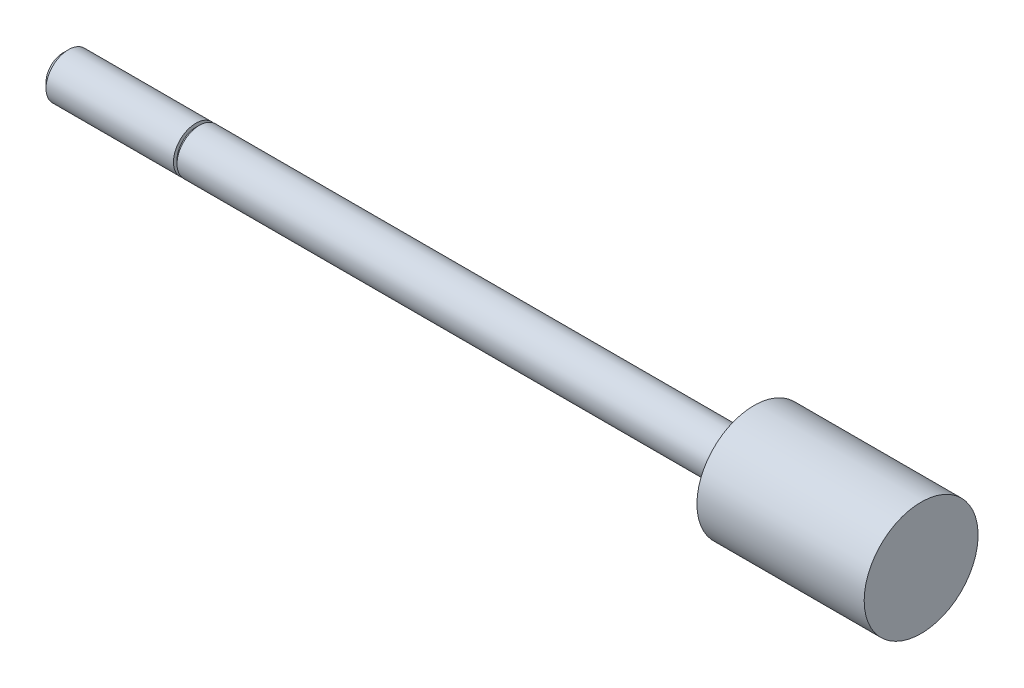
ISO-10303-21;
HEADER;
FILE_DESCRIPTION(('STEP AP214'),'2;1');
FILE_NAME('part.step','',(''),(''),'','','');
FILE_SCHEMA(('AUTOMOTIVE_DESIGN { 1 0 10303 214 1 1 1 1 }'));
ENDSEC;
DATA;
#1=APPLICATION_CONTEXT('core data for automotive mechanical design processes');
#2=APPLICATION_PROTOCOL_DEFINITION('international standard','automotive_design',2000,#1);
#3=PRODUCT_CONTEXT('',#1,'mechanical');
#4=PRODUCT('Part','Part','',(#3));
#5=PRODUCT_RELATED_PRODUCT_CATEGORY('part','',(#4));
#6=PRODUCT_DEFINITION_FORMATION('','',#4);
#7=PRODUCT_DEFINITION_CONTEXT('part definition',#1,'design');
#8=PRODUCT_DEFINITION('design','',#6,#7);
#9=PRODUCT_DEFINITION_SHAPE('','',#8);
#10=(LENGTH_UNIT() NAMED_UNIT(*) SI_UNIT(.MILLI.,.METRE.));
#11=(NAMED_UNIT(*) PLANE_ANGLE_UNIT() SI_UNIT($,.RADIAN.));
#12=(NAMED_UNIT(*) SI_UNIT($,.STERADIAN.) SOLID_ANGLE_UNIT());
#13=UNCERTAINTY_MEASURE_WITH_UNIT(LENGTH_MEASURE(1.E-05),#10,'distance_accuracy_value','');
#14=(GEOMETRIC_REPRESENTATION_CONTEXT(3) GLOBAL_UNCERTAINTY_ASSIGNED_CONTEXT((#13)) GLOBAL_UNIT_ASSIGNED_CONTEXT((#10,
#11,#12)) REPRESENTATION_CONTEXT('',''));
#15=CARTESIAN_POINT('',(0.,0.,0.));
#16=DIRECTION('',(0.,0.,1.));
#17=DIRECTION('',(1.,0.,0.));
#18=AXIS2_PLACEMENT_3D('',#15,#16,#17);
#19=CARTESIAN_POINT('',(51.0794,0.,0.));
#20=DIRECTION('',(-1.,0.,0.));
#21=DIRECTION('',(0.,0.,1.));
#22=AXIS2_PLACEMENT_3D('',#19,#20,#21);
#23=CYLINDRICAL_SURFACE('',#22,1.5875);
#24=CARTESIAN_POINT('',(39.243,0.,0.));
#25=DIRECTION('',(-1.,0.,0.));
#26=DIRECTION('',(0.,0.,1.));
#27=AXIS2_PLACEMENT_3D('',#24,#25,#26);
#28=CIRCLE('',#27,1.5875);
#29=CARTESIAN_POINT('',(39.243,0.,1.5875));
#30=VERTEX_POINT('',#29);
#31=EDGE_CURVE('E10',#30,#30,#28,.T.);
#32=ORIENTED_EDGE('',*,*,#31,.T.);
#33=EDGE_LOOP('',(#32));
#34=FACE_BOUND('',#33,.T.);
#35=CARTESIAN_POINT('',(0.,0.,0.));
#36=DIRECTION('',(-1.,0.,0.));
#37=DIRECTION('',(0.,0.,1.));
#38=AXIS2_PLACEMENT_3D('',#35,#36,#37);
#39=CIRCLE('',#38,1.5875);
#40=CARTESIAN_POINT('',(0.,0.,1.5875));
#41=VERTEX_POINT('',#40);
#42=EDGE_CURVE('E51',#41,#41,#39,.T.);
#43=ORIENTED_EDGE('',*,*,#42,.F.);
#44=EDGE_LOOP('',(#43));
#45=FACE_BOUND('',#44,.T.);
#46=ADVANCED_FACE('F35',(#34,#45),#23,.T.);
#47=CARTESIAN_POINT('',(39.243,1.5875,0.));
#48=DIRECTION('',(1.,0.,0.));
#49=DIRECTION('',(0.,0.,-1.));
#50=AXIS2_PLACEMENT_3D('',#47,#48,#49);
#51=PLANE('',#50);
#52=ORIENTED_EDGE('',*,*,#31,.F.);
#53=EDGE_LOOP('',(#52));
#54=FACE_BOUND('',#53,.T.);
#55=CARTESIAN_POINT('',(39.243,0.,0.));
#56=DIRECTION('',(-1.,0.,0.));
#57=DIRECTION('',(0.,0.,1.));
#58=AXIS2_PLACEMENT_3D('',#55,#56,#57);
#59=CIRCLE('',#58,4.03225);
#60=CARTESIAN_POINT('',(39.243,0.,4.03225));
#61=VERTEX_POINT('',#60);
#62=EDGE_CURVE('E43',#61,#61,#59,.T.);
#63=ORIENTED_EDGE('',*,*,#62,.T.);
#64=EDGE_LOOP('',(#63));
#65=FACE_BOUND('',#64,.T.);
#66=ADVANCED_FACE('F85',(#54,#65),#51,.F.);
#67=CARTESIAN_POINT('',(51.0794,0.,0.));
#68=DIRECTION('',(-1.,0.,0.));
#69=DIRECTION('',(0.,0.,1.));
#70=AXIS2_PLACEMENT_3D('',#67,#68,#69);
#71=CYLINDRICAL_SURFACE('',#70,4.03225);
#72=ORIENTED_EDGE('',*,*,#62,.F.);
#73=EDGE_LOOP('',(#72));
#74=FACE_BOUND('',#73,.T.);
#75=CARTESIAN_POINT('',(51.0794,0.,0.));
#76=DIRECTION('',(-1.,0.,0.));
#77=DIRECTION('',(0.,0.,1.));
#78=AXIS2_PLACEMENT_3D('',#75,#76,#77);
#79=CIRCLE('',#78,4.03225);
#80=CARTESIAN_POINT('',(51.0794,0.,4.03225));
#81=VERTEX_POINT('',#80);
#82=EDGE_CURVE('E48',#81,#81,#79,.T.);
#83=ORIENTED_EDGE('',*,*,#82,.T.);
#84=EDGE_LOOP('',(#83));
#85=FACE_BOUND('',#84,.T.);
#86=ADVANCED_FACE('F73',(#74,#85),#71,.T.);
#87=CARTESIAN_POINT('',(51.0794,4.03225,0.));
#88=DIRECTION('',(-1.,0.,0.));
#89=DIRECTION('',(0.,0.,1.));
#90=AXIS2_PLACEMENT_3D('',#87,#88,#89);
#91=PLANE('',#90);
#92=ORIENTED_EDGE('',*,*,#82,.F.);
#93=EDGE_LOOP('',(#92));
#94=FACE_BOUND('',#93,.T.);
#95=ADVANCED_FACE('F75',(#94),#91,.F.);
#96=CARTESIAN_POINT('',(-0.254,1.8415,0.));
#97=DIRECTION('',(1.,0.,0.));
#98=DIRECTION('',(0.,0.,-1.));
#99=AXIS2_PLACEMENT_3D('',#96,#97,#98);
#100=PLANE('',#99);
#101=CARTESIAN_POINT('',(-0.254,0.,0.));
#102=DIRECTION('',(-1.,0.,0.));
#103=DIRECTION('',(0.,0.,1.));
#104=AXIS2_PLACEMENT_3D('',#101,#102,#103);
#105=CIRCLE('',#104,1.3335);
#106=CARTESIAN_POINT('',(-0.254,0.,1.3335));
#107=VERTEX_POINT('',#106);
#108=EDGE_CURVE('E53',#107,#107,#105,.T.);
#109=ORIENTED_EDGE('',*,*,#108,.T.);
#110=EDGE_LOOP('',(#109));
#111=FACE_BOUND('',#110,.T.);
#112=CARTESIAN_POINT('',(-0.253999999999997,0.,0.));
#113=DIRECTION('',(1.,0.,0.));
#114=DIRECTION('',(0.,0.,-1.));
#115=AXIS2_PLACEMENT_3D('',#112,#113,#114);
#116=CIRCLE('',#115,1.5875);
#117=CARTESIAN_POINT('',(-0.253999999999997,0.,-1.5875));
#118=VERTEX_POINT('',#117);
#119=EDGE_CURVE('E39',#118,#118,#116,.T.);
#120=ORIENTED_EDGE('',*,*,#119,.T.);
#121=EDGE_LOOP('',(#120));
#122=FACE_BOUND('',#121,.T.);
#123=ADVANCED_FACE('F77',(#111,#122),#100,.T.);
#124=CARTESIAN_POINT('',(0.,1.3335,0.));
#125=DIRECTION('',(-1.,0.,0.));
#126=DIRECTION('',(0.,0.,1.));
#127=AXIS2_PLACEMENT_3D('',#124,#125,#126);
#128=PLANE('',#127);
#129=CARTESIAN_POINT('',(0.,0.,0.));
#130=DIRECTION('',(-1.,0.,0.));
#131=DIRECTION('',(0.,0.,1.));
#132=AXIS2_PLACEMENT_3D('',#129,#130,#131);
#133=CIRCLE('',#132,1.3335);
#134=CARTESIAN_POINT('',(0.,0.,1.3335));
#135=VERTEX_POINT('',#134);
#136=EDGE_CURVE('E59',#135,#135,#133,.T.);
#137=ORIENTED_EDGE('',*,*,#136,.F.);
#138=EDGE_LOOP('',(#137));
#139=FACE_BOUND('',#138,.T.);
#140=ORIENTED_EDGE('',*,*,#42,.T.);
#141=EDGE_LOOP('',(#140));
#142=FACE_BOUND('',#141,.T.);
#143=ADVANCED_FACE('F83',(#139,#142),#128,.T.);
#144=CARTESIAN_POINT('',(0.,0.,0.));
#145=DIRECTION('',(-1.,0.,0.));
#146=DIRECTION('',(0.,0.,1.));
#147=AXIS2_PLACEMENT_3D('',#144,#145,#146);
#148=CYLINDRICAL_SURFACE('',#147,1.3335);
#149=ORIENTED_EDGE('',*,*,#136,.T.);
#150=EDGE_LOOP('',(#149));
#151=FACE_BOUND('',#150,.T.);
#152=ORIENTED_EDGE('',*,*,#108,.F.);
#153=EDGE_LOOP('',(#152));
#154=FACE_BOUND('',#153,.T.);
#155=ADVANCED_FACE('F112',(#151,#154),#148,.T.);
#156=CARTESIAN_POINT('',(-9.652,0.,0.));
#157=DIRECTION('',(1.,0.,0.));
#158=DIRECTION('',(0.,0.,-1.));
#159=AXIS2_PLACEMENT_3D('',#156,#157,#158);
#160=PLANE('',#159);
#161=CARTESIAN_POINT('',(-9.652,0.,0.));
#162=DIRECTION('',(-1.,0.,0.));
#163=DIRECTION('',(0.,0.,1.));
#164=AXIS2_PLACEMENT_3D('',#161,#162,#163);
#165=CIRCLE('',#164,1.20904);
#166=CARTESIAN_POINT('',(-9.652,0.,1.20904));
#167=VERTEX_POINT('',#166);
#168=EDGE_CURVE('E68',#167,#167,#165,.T.);
#169=ORIENTED_EDGE('',*,*,#168,.T.);
#170=EDGE_LOOP('',(#169));
#171=FACE_BOUND('',#170,.T.);
#172=ADVANCED_FACE('F101',(#171),#160,.F.);
#173=CARTESIAN_POINT('',(-9.27354,0.,0.));
#174=DIRECTION('',(1.,0.,0.));
#175=DIRECTION('',(0.,0.,-1.));
#176=AXIS2_PLACEMENT_3D('',#173,#174,#175);
#177=CONICAL_SURFACE('',#176,1.5875,0.78539816339745);
#178=ORIENTED_EDGE('',*,*,#168,.F.);
#179=EDGE_LOOP('',(#178));
#180=FACE_BOUND('',#179,.T.);
#181=CARTESIAN_POINT('',(-9.27354,0.,0.));
#182=DIRECTION('',(-1.,0.,0.));
#183=DIRECTION('',(0.,0.,1.));
#184=AXIS2_PLACEMENT_3D('',#181,#182,#183);
#185=CIRCLE('',#184,1.5875);
#186=CARTESIAN_POINT('',(-9.27354,0.,1.5875));
#187=VERTEX_POINT('',#186);
#188=EDGE_CURVE('E57',#187,#187,#185,.T.);
#189=ORIENTED_EDGE('',*,*,#188,.T.);
#190=EDGE_LOOP('',(#189));
#191=FACE_BOUND('',#190,.T.);
#192=ADVANCED_FACE('F96',(#180,#191),#177,.T.);
#193=ORIENTED_EDGE('',*,*,#188,.F.);
#194=EDGE_LOOP('',(#193));
#195=FACE_BOUND('',#194,.T.);
#196=ORIENTED_EDGE('',*,*,#119,.F.);
#197=EDGE_LOOP('',(#196));
#198=FACE_BOUND('',#197,.T.);
#199=ADVANCED_FACE('F37',(#195,#198),#23,.T.);
#200=CLOSED_SHELL('',(#46,#66,#86,#95,#123,#143,#155,#172,#192,#199));
#201=MANIFOLD_SOLID_BREP('B2',#200);
#202=ADVANCED_BREP_SHAPE_REPRESENTATION('',(#18,#201),#14);
#203=SHAPE_DEFINITION_REPRESENTATION(#9,#202);
ENDSEC;
END-ISO-10303-21;
